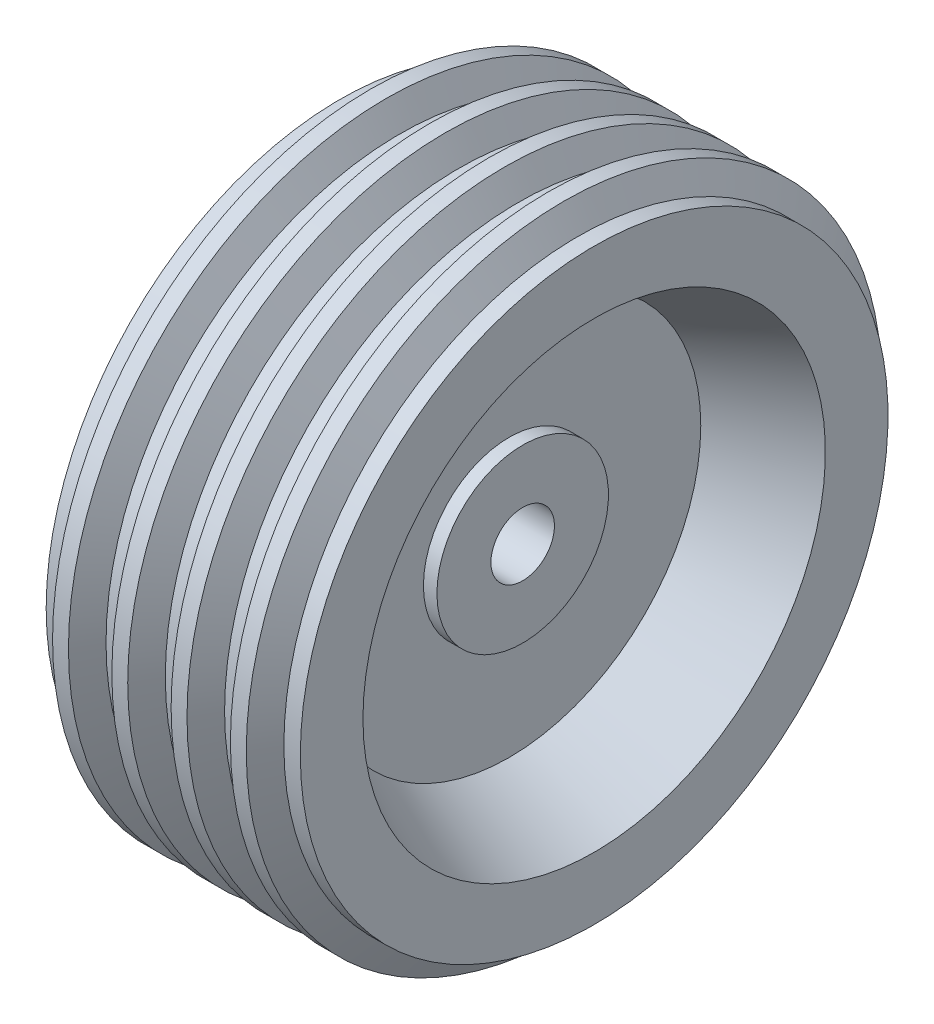
ISO-10303-21;
HEADER;
FILE_DESCRIPTION(('STEP AP214'),'2;1');
FILE_NAME('part.step','',(''),(''),'','','');
FILE_SCHEMA(('AUTOMOTIVE_DESIGN { 1 0 10303 214 1 1 1 1 }'));
ENDSEC;
DATA;
#1=APPLICATION_CONTEXT('core data for automotive mechanical design processes');
#2=APPLICATION_PROTOCOL_DEFINITION('international standard','automotive_design',2000,#1);
#3=PRODUCT_CONTEXT('',#1,'mechanical');
#4=PRODUCT('Part','Part','',(#3));
#5=PRODUCT_RELATED_PRODUCT_CATEGORY('part','',(#4));
#6=PRODUCT_DEFINITION_FORMATION('','',#4);
#7=PRODUCT_DEFINITION_CONTEXT('part definition',#1,'design');
#8=PRODUCT_DEFINITION('design','',#6,#7);
#9=PRODUCT_DEFINITION_SHAPE('','',#8);
#10=(LENGTH_UNIT() NAMED_UNIT(*) SI_UNIT(.MILLI.,.METRE.));
#11=(NAMED_UNIT(*) PLANE_ANGLE_UNIT() SI_UNIT($,.RADIAN.));
#12=(NAMED_UNIT(*) SI_UNIT($,.STERADIAN.) SOLID_ANGLE_UNIT());
#13=UNCERTAINTY_MEASURE_WITH_UNIT(LENGTH_MEASURE(1.E-05),#10,'distance_accuracy_value','');
#14=(GEOMETRIC_REPRESENTATION_CONTEXT(3) GLOBAL_UNCERTAINTY_ASSIGNED_CONTEXT((#13)) GLOBAL_UNIT_ASSIGNED_CONTEXT((#10,
#11,#12)) REPRESENTATION_CONTEXT('',''));
#15=CARTESIAN_POINT('',(0.,0.,0.));
#16=DIRECTION('',(0.,0.,1.));
#17=DIRECTION('',(1.,0.,0.));
#18=AXIS2_PLACEMENT_3D('',#15,#16,#17);
#19=CARTESIAN_POINT('',(-192.570696620357,0.,0.));
#20=DIRECTION('',(-1.,0.,0.));
#21=DIRECTION('',(0.,0.,1.));
#22=AXIS2_PLACEMENT_3D('',#19,#20,#21);
#23=CYLINDRICAL_SURFACE('',#22,20.);
#24=CARTESIAN_POINT('',(35.,0.,0.));
#25=DIRECTION('',(-1.,0.,0.));
#26=DIRECTION('',(0.,0.,1.));
#27=AXIS2_PLACEMENT_3D('',#24,#25,#26);
#28=CIRCLE('',#27,20.);
#29=CARTESIAN_POINT('',(35.,0.,20.));
#30=VERTEX_POINT('',#29);
#31=EDGE_CURVE('E10',#30,#30,#28,.T.);
#32=ORIENTED_EDGE('',*,*,#31,.F.);
#33=EDGE_LOOP('',(#32));
#34=FACE_BOUND('',#33,.T.);
#35=CARTESIAN_POINT('',(-35.,0.,0.));
#36=DIRECTION('',(-1.,0.,0.));
#37=DIRECTION('',(0.,0.,1.));
#38=AXIS2_PLACEMENT_3D('',#35,#36,#37);
#39=CIRCLE('',#38,20.);
#40=CARTESIAN_POINT('',(-35.,0.,20.));
#41=VERTEX_POINT('',#40);
#42=EDGE_CURVE('E152',#41,#41,#39,.T.);
#43=ORIENTED_EDGE('',*,*,#42,.T.);
#44=EDGE_LOOP('',(#43));
#45=FACE_BOUND('',#44,.T.);
#46=ADVANCED_FACE('F37',(#34,#45),#23,.F.);
#47=CARTESIAN_POINT('',(35.,0.,0.));
#48=DIRECTION('',(-1.,0.,0.));
#49=DIRECTION('',(0.,0.,1.));
#50=AXIS2_PLACEMENT_3D('',#47,#48,#49);
#51=PLANE('',#50);
#52=CARTESIAN_POINT('',(35.,0.,0.));
#53=DIRECTION('',(-1.,0.,0.));
#54=DIRECTION('',(0.,0.,1.));
#55=AXIS2_PLACEMENT_3D('',#52,#53,#54);
#56=CIRCLE('',#55,54.);
#57=CARTESIAN_POINT('',(35.,0.,54.));
#58=VERTEX_POINT('',#57);
#59=EDGE_CURVE('E44',#58,#58,#56,.T.);
#60=ORIENTED_EDGE('',*,*,#59,.F.);
#61=EDGE_LOOP('',(#60));
#62=FACE_BOUND('',#61,.T.);
#63=ORIENTED_EDGE('',*,*,#31,.T.);
#64=EDGE_LOOP('',(#63));
#65=FACE_BOUND('',#64,.T.);
#66=ADVANCED_FACE('F170',(#62,#65),#51,.F.);
#67=CARTESIAN_POINT('',(-192.570696620357,0.,0.));
#68=DIRECTION('',(-1.,0.,0.));
#69=DIRECTION('',(0.,0.,1.));
#70=AXIS2_PLACEMENT_3D('',#67,#68,#69);
#71=CYLINDRICAL_SURFACE('',#70,54.);
#72=CARTESIAN_POINT('',(26.5,0.,0.));
#73=DIRECTION('',(-1.,0.,0.));
#74=DIRECTION('',(0.,0.,1.));
#75=AXIS2_PLACEMENT_3D('',#72,#73,#74);
#76=CIRCLE('',#75,54.);
#77=CARTESIAN_POINT('',(26.5,0.,54.));
#78=VERTEX_POINT('',#77);
#79=EDGE_CURVE('E49',#78,#78,#76,.T.);
#80=ORIENTED_EDGE('',*,*,#79,.F.);
#81=EDGE_LOOP('',(#80));
#82=FACE_BOUND('',#81,.T.);
#83=ORIENTED_EDGE('',*,*,#59,.T.);
#84=EDGE_LOOP('',(#83));
#85=FACE_BOUND('',#84,.T.);
#86=ADVANCED_FACE('F175',(#82,#85),#71,.T.);
#87=CARTESIAN_POINT('',(26.5,0.,0.));
#88=DIRECTION('',(1.,0.,0.));
#89=DIRECTION('',(0.,0.,-1.));
#90=AXIS2_PLACEMENT_3D('',#87,#88,#89);
#91=PLANE('',#90);
#92=ORIENTED_EDGE('',*,*,#79,.T.);
#93=EDGE_LOOP('',(#92));
#94=FACE_BOUND('',#93,.T.);
#95=CARTESIAN_POINT('',(26.5,0.,0.));
#96=DIRECTION('',(-1.,0.,0.));
#97=DIRECTION('',(0.,0.,1.));
#98=AXIS2_PLACEMENT_3D('',#95,#96,#97);
#99=CIRCLE('',#98,120.622540288708);
#100=CARTESIAN_POINT('',(26.5,0.,120.622540288708));
#101=VERTEX_POINT('',#100);
#102=EDGE_CURVE('E54',#101,#101,#99,.T.);
#103=ORIENTED_EDGE('',*,*,#102,.F.);
#104=EDGE_LOOP('',(#103));
#105=FACE_BOUND('',#104,.T.);
#106=ADVANCED_FACE('F180',(#94,#105),#91,.T.);
#107=CARTESIAN_POINT('',(80.,0.,0.));
#108=DIRECTION('',(1.,0.,0.));
#109=DIRECTION('',(0.,0.,-1.));
#110=AXIS2_PLACEMENT_3D('',#107,#108,#109);
#111=CONICAL_SURFACE('',#110,145.57,0.436332312998579);
#112=ORIENTED_EDGE('',*,*,#102,.T.);
#113=EDGE_LOOP('',(#112));
#114=FACE_BOUND('',#113,.T.);
#115=CARTESIAN_POINT('',(80.,0.,0.));
#116=DIRECTION('',(-1.,0.,0.));
#117=DIRECTION('',(0.,0.,1.));
#118=AXIS2_PLACEMENT_3D('',#115,#116,#117);
#119=CIRCLE('',#118,145.57);
#120=CARTESIAN_POINT('',(80.,0.,145.57));
#121=VERTEX_POINT('',#120);
#122=EDGE_CURVE('E60',#121,#121,#119,.T.);
#123=ORIENTED_EDGE('',*,*,#122,.F.);
#124=EDGE_LOOP('',(#123));
#125=FACE_BOUND('',#124,.T.);
#126=ADVANCED_FACE('F186',(#114,#125),#111,.F.);
#127=CARTESIAN_POINT('',(80.,0.,0.));
#128=DIRECTION('',(1.,0.,0.));
#129=DIRECTION('',(0.,0.,-1.));
#130=AXIS2_PLACEMENT_3D('',#127,#128,#129);
#131=PLANE('',#130);
#132=ORIENTED_EDGE('',*,*,#122,.T.);
#133=EDGE_LOOP('',(#132));
#134=FACE_BOUND('',#133,.T.);
#135=CARTESIAN_POINT('',(80.,0.,0.));
#136=DIRECTION('',(-1.,0.,0.));
#137=DIRECTION('',(0.,0.,1.));
#138=AXIS2_PLACEMENT_3D('',#135,#136,#137);
#139=CIRCLE('',#138,185.);
#140=CARTESIAN_POINT('',(80.,0.,185.));
#141=VERTEX_POINT('',#140);
#142=EDGE_CURVE('E64',#141,#141,#139,.T.);
#143=ORIENTED_EDGE('',*,*,#142,.F.);
#144=EDGE_LOOP('',(#143));
#145=FACE_BOUND('',#144,.T.);
#146=ADVANCED_FACE('F190',(#134,#145),#131,.T.);
#147=CARTESIAN_POINT('',(-192.570696620357,0.,0.));
#148=DIRECTION('',(-1.,0.,0.));
#149=DIRECTION('',(0.,0.,1.));
#150=AXIS2_PLACEMENT_3D('',#147,#148,#149);
#151=CYLINDRICAL_SURFACE('',#150,185.);
#152=CARTESIAN_POINT('',(69.6410161513781,0.,0.));
#153=DIRECTION('',(-1.,0.,0.));
#154=DIRECTION('',(0.,0.,1.));
#155=AXIS2_PLACEMENT_3D('',#152,#153,#154);
#156=CIRCLE('',#155,185.);
#157=CARTESIAN_POINT('',(69.6410161513781,0.,185.));
#158=VERTEX_POINT('',#157);
#159=EDGE_CURVE('E68',#158,#158,#156,.T.);
#160=ORIENTED_EDGE('',*,*,#159,.F.);
#161=EDGE_LOOP('',(#160));
#162=FACE_BOUND('',#161,.T.);
#163=ORIENTED_EDGE('',*,*,#142,.T.);
#164=EDGE_LOOP('',(#163));
#165=FACE_BOUND('',#164,.T.);
#166=ADVANCED_FACE('F194',(#162,#165),#151,.T.);
#167=CARTESIAN_POINT('',(69.6410161513781,0.,0.));
#168=DIRECTION('',(-1.,0.,0.));
#169=DIRECTION('',(0.,0.,1.));
#170=AXIS2_PLACEMENT_3D('',#167,#168,#169);
#171=CONICAL_SURFACE('',#170,185.,1.04719755119659);
#172=CARTESIAN_POINT('',(60.9807621135336,0.,0.));
#173=DIRECTION('',(-1.,0.,0.));
#174=DIRECTION('',(0.,0.,1.));
#175=AXIS2_PLACEMENT_3D('',#172,#173,#174);
#176=CIRCLE('',#175,200.);
#177=CARTESIAN_POINT('',(60.9807621135336,0.,200.));
#178=VERTEX_POINT('',#177);
#179=EDGE_CURVE('E72',#178,#178,#176,.T.);
#180=ORIENTED_EDGE('',*,*,#179,.F.);
#181=EDGE_LOOP('',(#180));
#182=FACE_BOUND('',#181,.T.);
#183=ORIENTED_EDGE('',*,*,#159,.T.);
#184=EDGE_LOOP('',(#183));
#185=FACE_BOUND('',#184,.T.);
#186=ADVANCED_FACE('F198',(#182,#185),#171,.T.);
#187=CARTESIAN_POINT('',(-192.570696620357,0.,0.));
#188=DIRECTION('',(-1.,0.,0.));
#189=DIRECTION('',(0.,0.,1.));
#190=AXIS2_PLACEMENT_3D('',#187,#188,#189);
#191=CYLINDRICAL_SURFACE('',#190,199.999999999999);
#192=CARTESIAN_POINT('',(50.9807621135336,0.,0.));
#193=DIRECTION('',(-1.,0.,0.));
#194=DIRECTION('',(0.,0.,1.));
#195=AXIS2_PLACEMENT_3D('',#192,#193,#194);
#196=CIRCLE('',#195,199.999999999998);
#197=CARTESIAN_POINT('',(50.9807621135336,0.,199.999999999998));
#198=VERTEX_POINT('',#197);
#199=EDGE_CURVE('E76',#198,#198,#196,.T.);
#200=ORIENTED_EDGE('',*,*,#199,.F.);
#201=EDGE_LOOP('',(#200));
#202=FACE_BOUND('',#201,.T.);
#203=ORIENTED_EDGE('',*,*,#179,.T.);
#204=EDGE_LOOP('',(#203));
#205=FACE_BOUND('',#204,.T.);
#206=ADVANCED_FACE('F202',(#202,#205),#191,.T.);
#207=CARTESIAN_POINT('',(50.9807621135336,0.,0.));
#208=DIRECTION('',(1.,0.,0.));
#209=DIRECTION('',(0.,0.,-1.));
#210=AXIS2_PLACEMENT_3D('',#207,#208,#209);
#211=CONICAL_SURFACE('',#210,199.999999999998,1.04719755119659);
#212=CARTESIAN_POINT('',(42.3205080756901,0.,0.));
#213=DIRECTION('',(-1.,0.,0.));
#214=DIRECTION('',(0.,0.,1.));
#215=AXIS2_PLACEMENT_3D('',#212,#213,#214);
#216=CIRCLE('',#215,185.);
#217=CARTESIAN_POINT('',(42.3205080756901,0.,185.));
#218=VERTEX_POINT('',#217);
#219=EDGE_CURVE('E80',#218,#218,#216,.T.);
#220=ORIENTED_EDGE('',*,*,#219,.F.);
#221=EDGE_LOOP('',(#220));
#222=FACE_BOUND('',#221,.T.);
#223=ORIENTED_EDGE('',*,*,#199,.T.);
#224=EDGE_LOOP('',(#223));
#225=FACE_BOUND('',#224,.T.);
#226=ADVANCED_FACE('F206',(#222,#225),#211,.T.);
#227=CARTESIAN_POINT('',(-192.570696620357,0.,0.));
#228=DIRECTION('',(-1.,0.,0.));
#229=DIRECTION('',(0.,0.,1.));
#230=AXIS2_PLACEMENT_3D('',#227,#228,#229);
#231=CYLINDRICAL_SURFACE('',#230,185.);
#232=CARTESIAN_POINT('',(32.3205080756901,0.,0.));
#233=DIRECTION('',(-1.,0.,0.));
#234=DIRECTION('',(0.,0.,1.));
#235=AXIS2_PLACEMENT_3D('',#232,#233,#234);
#236=CIRCLE('',#235,185.);
#237=CARTESIAN_POINT('',(32.3205080756901,0.,185.));
#238=VERTEX_POINT('',#237);
#239=EDGE_CURVE('E84',#238,#238,#236,.T.);
#240=ORIENTED_EDGE('',*,*,#239,.F.);
#241=EDGE_LOOP('',(#240));
#242=FACE_BOUND('',#241,.T.);
#243=ORIENTED_EDGE('',*,*,#219,.T.);
#244=EDGE_LOOP('',(#243));
#245=FACE_BOUND('',#244,.T.);
#246=ADVANCED_FACE('F210',(#242,#245),#231,.T.);
#247=CARTESIAN_POINT('',(23.6602540378456,0.,0.));
#248=DIRECTION('',(-1.,0.,0.));
#249=DIRECTION('',(0.,0.,1.));
#250=AXIS2_PLACEMENT_3D('',#247,#248,#249);
#251=CONICAL_SURFACE('',#250,200.,1.04719755119659);
#252=ORIENTED_EDGE('',*,*,#239,.T.);
#253=EDGE_LOOP('',(#252));
#254=FACE_BOUND('',#253,.T.);
#255=CARTESIAN_POINT('',(23.6602540378456,0.,0.));
#256=DIRECTION('',(-1.,0.,0.));
#257=DIRECTION('',(0.,0.,1.));
#258=AXIS2_PLACEMENT_3D('',#255,#256,#257);
#259=CIRCLE('',#258,200.);
#260=CARTESIAN_POINT('',(23.6602540378456,0.,200.));
#261=VERTEX_POINT('',#260);
#262=EDGE_CURVE('E88',#261,#261,#259,.T.);
#263=ORIENTED_EDGE('',*,*,#262,.F.);
#264=EDGE_LOOP('',(#263));
#265=FACE_BOUND('',#264,.T.);
#266=ADVANCED_FACE('F214',(#254,#265),#251,.T.);
#267=CARTESIAN_POINT('',(-192.570696620357,0.,0.));
#268=DIRECTION('',(-1.,0.,0.));
#269=DIRECTION('',(0.,0.,1.));
#270=AXIS2_PLACEMENT_3D('',#267,#268,#269);
#271=CYLINDRICAL_SURFACE('',#270,200.);
#272=ORIENTED_EDGE('',*,*,#262,.T.);
#273=EDGE_LOOP('',(#272));
#274=FACE_BOUND('',#273,.T.);
#275=CARTESIAN_POINT('',(13.6602540378456,0.,0.));
#276=DIRECTION('',(-1.,0.,0.));
#277=DIRECTION('',(0.,0.,1.));
#278=AXIS2_PLACEMENT_3D('',#275,#276,#277);
#279=CIRCLE('',#278,200.);
#280=CARTESIAN_POINT('',(13.6602540378456,0.,200.));
#281=VERTEX_POINT('',#280);
#282=EDGE_CURVE('E92',#281,#281,#279,.T.);
#283=ORIENTED_EDGE('',*,*,#282,.F.);
#284=EDGE_LOOP('',(#283));
#285=FACE_BOUND('',#284,.T.);
#286=ADVANCED_FACE('F218',(#274,#285),#271,.T.);
#287=CARTESIAN_POINT('',(5.0000000000005,0.,0.));
#288=DIRECTION('',(1.,0.,0.));
#289=DIRECTION('',(0.,0.,-1.));
#290=AXIS2_PLACEMENT_3D('',#287,#288,#289);
#291=CONICAL_SURFACE('',#290,185.,1.04719755119657);
#292=ORIENTED_EDGE('',*,*,#282,.T.);
#293=EDGE_LOOP('',(#292));
#294=FACE_BOUND('',#293,.T.);
#295=CARTESIAN_POINT('',(5.0000000000005,0.,0.));
#296=DIRECTION('',(-1.,0.,0.));
#297=DIRECTION('',(0.,0.,1.));
#298=AXIS2_PLACEMENT_3D('',#295,#296,#297);
#299=CIRCLE('',#298,185.);
#300=CARTESIAN_POINT('',(5.0000000000005,0.,185.));
#301=VERTEX_POINT('',#300);
#302=EDGE_CURVE('E96',#301,#301,#299,.T.);
#303=ORIENTED_EDGE('',*,*,#302,.F.);
#304=EDGE_LOOP('',(#303));
#305=FACE_BOUND('',#304,.T.);
#306=ADVANCED_FACE('F222',(#294,#305),#291,.T.);
#307=CARTESIAN_POINT('',(-192.570696620357,0.,0.));
#308=DIRECTION('',(-1.,0.,0.));
#309=DIRECTION('',(0.,0.,1.));
#310=AXIS2_PLACEMENT_3D('',#307,#308,#309);
#311=CYLINDRICAL_SURFACE('',#310,185.);
#312=ORIENTED_EDGE('',*,*,#302,.T.);
#313=EDGE_LOOP('',(#312));
#314=FACE_BOUND('',#313,.T.);
#315=CARTESIAN_POINT('',(-5.0000000000005,0.,0.));
#316=DIRECTION('',(-1.,0.,0.));
#317=DIRECTION('',(0.,0.,1.));
#318=AXIS2_PLACEMENT_3D('',#315,#316,#317);
#319=CIRCLE('',#318,185.);
#320=CARTESIAN_POINT('',(-5.0000000000005,0.,185.));
#321=VERTEX_POINT('',#320);
#322=EDGE_CURVE('E100',#321,#321,#319,.T.);
#323=ORIENTED_EDGE('',*,*,#322,.F.);
#324=EDGE_LOOP('',(#323));
#325=FACE_BOUND('',#324,.T.);
#326=ADVANCED_FACE('F226',(#314,#325),#311,.T.);
#327=CARTESIAN_POINT('',(-5.0000000000005,0.,0.));
#328=DIRECTION('',(-1.,0.,0.));
#329=DIRECTION('',(0.,0.,1.));
#330=AXIS2_PLACEMENT_3D('',#327,#328,#329);
#331=CONICAL_SURFACE('',#330,185.,1.04719755119656);
#332=CARTESIAN_POINT('',(-13.6602540378456,0.,0.));
#333=DIRECTION('',(-1.,0.,0.));
#334=DIRECTION('',(0.,0.,1.));
#335=AXIS2_PLACEMENT_3D('',#332,#333,#334);
#336=CIRCLE('',#335,200.);
#337=CARTESIAN_POINT('',(-13.6602540378456,0.,200.));
#338=VERTEX_POINT('',#337);
#339=EDGE_CURVE('E104',#338,#338,#336,.T.);
#340=ORIENTED_EDGE('',*,*,#339,.F.);
#341=EDGE_LOOP('',(#340));
#342=FACE_BOUND('',#341,.T.);
#343=ORIENTED_EDGE('',*,*,#322,.T.);
#344=EDGE_LOOP('',(#343));
#345=FACE_BOUND('',#344,.T.);
#346=ADVANCED_FACE('F230',(#342,#345),#331,.T.);
#347=CARTESIAN_POINT('',(-192.570696620357,0.,0.));
#348=DIRECTION('',(-1.,0.,0.));
#349=DIRECTION('',(0.,0.,1.));
#350=AXIS2_PLACEMENT_3D('',#347,#348,#349);
#351=CYLINDRICAL_SURFACE('',#350,200.);
#352=CARTESIAN_POINT('',(-23.6602540378456,0.,0.));
#353=DIRECTION('',(-1.,0.,0.));
#354=DIRECTION('',(0.,0.,1.));
#355=AXIS2_PLACEMENT_3D('',#352,#353,#354);
#356=CIRCLE('',#355,200.);
#357=CARTESIAN_POINT('',(-23.6602540378456,0.,200.));
#358=VERTEX_POINT('',#357);
#359=EDGE_CURVE('E108',#358,#358,#356,.T.);
#360=ORIENTED_EDGE('',*,*,#359,.F.);
#361=EDGE_LOOP('',(#360));
#362=FACE_BOUND('',#361,.T.);
#363=ORIENTED_EDGE('',*,*,#339,.T.);
#364=EDGE_LOOP('',(#363));
#365=FACE_BOUND('',#364,.T.);
#366=ADVANCED_FACE('F234',(#362,#365),#351,.T.);
#367=CARTESIAN_POINT('',(-23.6602540378456,0.,0.));
#368=DIRECTION('',(1.,0.,0.));
#369=DIRECTION('',(0.,0.,-1.));
#370=AXIS2_PLACEMENT_3D('',#367,#368,#369);
#371=CONICAL_SURFACE('',#370,200.,1.04719755119659);
#372=CARTESIAN_POINT('',(-32.3205080756901,0.,0.));
#373=DIRECTION('',(-1.,0.,0.));
#374=DIRECTION('',(0.,0.,1.));
#375=AXIS2_PLACEMENT_3D('',#372,#373,#374);
#376=CIRCLE('',#375,185.);
#377=CARTESIAN_POINT('',(-32.3205080756901,0.,185.));
#378=VERTEX_POINT('',#377);
#379=EDGE_CURVE('E112',#378,#378,#376,.T.);
#380=ORIENTED_EDGE('',*,*,#379,.F.);
#381=EDGE_LOOP('',(#380));
#382=FACE_BOUND('',#381,.T.);
#383=ORIENTED_EDGE('',*,*,#359,.T.);
#384=EDGE_LOOP('',(#383));
#385=FACE_BOUND('',#384,.T.);
#386=ADVANCED_FACE('F238',(#382,#385),#371,.T.);
#387=CARTESIAN_POINT('',(-192.570696620357,0.,0.));
#388=DIRECTION('',(-1.,0.,0.));
#389=DIRECTION('',(0.,0.,1.));
#390=AXIS2_PLACEMENT_3D('',#387,#388,#389);
#391=CYLINDRICAL_SURFACE('',#390,185.);
#392=CARTESIAN_POINT('',(-42.3205080756901,0.,0.));
#393=DIRECTION('',(-1.,0.,0.));
#394=DIRECTION('',(0.,0.,1.));
#395=AXIS2_PLACEMENT_3D('',#392,#393,#394);
#396=CIRCLE('',#395,185.);
#397=CARTESIAN_POINT('',(-42.3205080756901,0.,185.));
#398=VERTEX_POINT('',#397);
#399=EDGE_CURVE('E116',#398,#398,#396,.T.);
#400=ORIENTED_EDGE('',*,*,#399,.F.);
#401=EDGE_LOOP('',(#400));
#402=FACE_BOUND('',#401,.T.);
#403=ORIENTED_EDGE('',*,*,#379,.T.);
#404=EDGE_LOOP('',(#403));
#405=FACE_BOUND('',#404,.T.);
#406=ADVANCED_FACE('F242',(#402,#405),#391,.T.);
#407=CARTESIAN_POINT('',(-50.9807621135335,0.,0.));
#408=DIRECTION('',(-1.,0.,0.));
#409=DIRECTION('',(0.,0.,1.));
#410=AXIS2_PLACEMENT_3D('',#407,#408,#409);
#411=CONICAL_SURFACE('',#410,199.999999999998,1.04719755119659);
#412=ORIENTED_EDGE('',*,*,#399,.T.);
#413=EDGE_LOOP('',(#412));
#414=FACE_BOUND('',#413,.T.);
#415=CARTESIAN_POINT('',(-50.9807621135335,0.,0.));
#416=DIRECTION('',(-1.,0.,0.));
#417=DIRECTION('',(0.,0.,1.));
#418=AXIS2_PLACEMENT_3D('',#415,#416,#417);
#419=CIRCLE('',#418,199.999999999998);
#420=CARTESIAN_POINT('',(-50.9807621135335,0.,199.999999999998));
#421=VERTEX_POINT('',#420);
#422=EDGE_CURVE('E120',#421,#421,#419,.T.);
#423=ORIENTED_EDGE('',*,*,#422,.F.);
#424=EDGE_LOOP('',(#423));
#425=FACE_BOUND('',#424,.T.);
#426=ADVANCED_FACE('F246',(#414,#425),#411,.T.);
#427=CARTESIAN_POINT('',(-192.570696620357,0.,0.));
#428=DIRECTION('',(-1.,0.,0.));
#429=DIRECTION('',(0.,0.,1.));
#430=AXIS2_PLACEMENT_3D('',#427,#428,#429);
#431=CYLINDRICAL_SURFACE('',#430,199.999999999999);
#432=ORIENTED_EDGE('',*,*,#422,.T.);
#433=EDGE_LOOP('',(#432));
#434=FACE_BOUND('',#433,.T.);
#435=CARTESIAN_POINT('',(-60.9807621135336,0.,0.));
#436=DIRECTION('',(-1.,0.,0.));
#437=DIRECTION('',(0.,0.,1.));
#438=AXIS2_PLACEMENT_3D('',#435,#436,#437);
#439=CIRCLE('',#438,200.);
#440=CARTESIAN_POINT('',(-60.9807621135336,0.,200.));
#441=VERTEX_POINT('',#440);
#442=EDGE_CURVE('E124',#441,#441,#439,.T.);
#443=ORIENTED_EDGE('',*,*,#442,.F.);
#444=EDGE_LOOP('',(#443));
#445=FACE_BOUND('',#444,.T.);
#446=ADVANCED_FACE('F250',(#434,#445),#431,.T.);
#447=CARTESIAN_POINT('',(-69.6410161513781,0.,0.));
#448=DIRECTION('',(1.,0.,0.));
#449=DIRECTION('',(0.,0.,-1.));
#450=AXIS2_PLACEMENT_3D('',#447,#448,#449);
#451=CONICAL_SURFACE('',#450,185.,1.04719755119659);
#452=ORIENTED_EDGE('',*,*,#442,.T.);
#453=EDGE_LOOP('',(#452));
#454=FACE_BOUND('',#453,.T.);
#455=CARTESIAN_POINT('',(-69.6410161513781,0.,0.));
#456=DIRECTION('',(-1.,0.,0.));
#457=DIRECTION('',(0.,0.,1.));
#458=AXIS2_PLACEMENT_3D('',#455,#456,#457);
#459=CIRCLE('',#458,185.);
#460=CARTESIAN_POINT('',(-69.6410161513781,0.,185.));
#461=VERTEX_POINT('',#460);
#462=EDGE_CURVE('E128',#461,#461,#459,.T.);
#463=ORIENTED_EDGE('',*,*,#462,.F.);
#464=EDGE_LOOP('',(#463));
#465=FACE_BOUND('',#464,.T.);
#466=ADVANCED_FACE('F254',(#454,#465),#451,.T.);
#467=CARTESIAN_POINT('',(-192.570696620357,0.,0.));
#468=DIRECTION('',(-1.,0.,0.));
#469=DIRECTION('',(0.,0.,1.));
#470=AXIS2_PLACEMENT_3D('',#467,#468,#469);
#471=CYLINDRICAL_SURFACE('',#470,185.);
#472=ORIENTED_EDGE('',*,*,#462,.T.);
#473=EDGE_LOOP('',(#472));
#474=FACE_BOUND('',#473,.T.);
#475=CARTESIAN_POINT('',(-80.,0.,0.));
#476=DIRECTION('',(-1.,0.,0.));
#477=DIRECTION('',(0.,0.,1.));
#478=AXIS2_PLACEMENT_3D('',#475,#476,#477);
#479=CIRCLE('',#478,185.);
#480=CARTESIAN_POINT('',(-80.,0.,185.));
#481=VERTEX_POINT('',#480);
#482=EDGE_CURVE('E132',#481,#481,#479,.T.);
#483=ORIENTED_EDGE('',*,*,#482,.F.);
#484=EDGE_LOOP('',(#483));
#485=FACE_BOUND('',#484,.T.);
#486=ADVANCED_FACE('F258',(#474,#485),#471,.T.);
#487=CARTESIAN_POINT('',(-80.,0.,0.));
#488=DIRECTION('',(1.,0.,0.));
#489=DIRECTION('',(0.,0.,-1.));
#490=AXIS2_PLACEMENT_3D('',#487,#488,#489);
#491=PLANE('',#490);
#492=CARTESIAN_POINT('',(-80.,0.,0.));
#493=DIRECTION('',(-1.,0.,0.));
#494=DIRECTION('',(0.,0.,1.));
#495=AXIS2_PLACEMENT_3D('',#492,#493,#494);
#496=CIRCLE('',#495,145.57);
#497=CARTESIAN_POINT('',(-80.,0.,145.57));
#498=VERTEX_POINT('',#497);
#499=EDGE_CURVE('E136',#498,#498,#496,.T.);
#500=ORIENTED_EDGE('',*,*,#499,.F.);
#501=EDGE_LOOP('',(#500));
#502=FACE_BOUND('',#501,.T.);
#503=ORIENTED_EDGE('',*,*,#482,.T.);
#504=EDGE_LOOP('',(#503));
#505=FACE_BOUND('',#504,.T.);
#506=ADVANCED_FACE('F262',(#502,#505),#491,.F.);
#507=CARTESIAN_POINT('',(-80.,0.,0.));
#508=DIRECTION('',(-1.,0.,0.));
#509=DIRECTION('',(0.,0.,1.));
#510=AXIS2_PLACEMENT_3D('',#507,#508,#509);
#511=CONICAL_SURFACE('',#510,145.57,0.43633231299858);
#512=CARTESIAN_POINT('',(-26.5,0.,0.));
#513=DIRECTION('',(-1.,0.,0.));
#514=DIRECTION('',(0.,0.,1.));
#515=AXIS2_PLACEMENT_3D('',#512,#513,#514);
#516=CIRCLE('',#515,120.622540288708);
#517=CARTESIAN_POINT('',(-26.5,0.,120.622540288708));
#518=VERTEX_POINT('',#517);
#519=EDGE_CURVE('E140',#518,#518,#516,.T.);
#520=ORIENTED_EDGE('',*,*,#519,.F.);
#521=EDGE_LOOP('',(#520));
#522=FACE_BOUND('',#521,.T.);
#523=ORIENTED_EDGE('',*,*,#499,.T.);
#524=EDGE_LOOP('',(#523));
#525=FACE_BOUND('',#524,.T.);
#526=ADVANCED_FACE('F266',(#522,#525),#511,.F.);
#527=CARTESIAN_POINT('',(-26.5,0.,0.));
#528=DIRECTION('',(1.,0.,0.));
#529=DIRECTION('',(0.,0.,-1.));
#530=AXIS2_PLACEMENT_3D('',#527,#528,#529);
#531=PLANE('',#530);
#532=CARTESIAN_POINT('',(-26.5,0.,0.));
#533=DIRECTION('',(-1.,0.,0.));
#534=DIRECTION('',(0.,0.,1.));
#535=AXIS2_PLACEMENT_3D('',#532,#533,#534);
#536=CIRCLE('',#535,54.);
#537=CARTESIAN_POINT('',(-26.5,0.,54.));
#538=VERTEX_POINT('',#537);
#539=EDGE_CURVE('E144',#538,#538,#536,.T.);
#540=ORIENTED_EDGE('',*,*,#539,.F.);
#541=EDGE_LOOP('',(#540));
#542=FACE_BOUND('',#541,.T.);
#543=ORIENTED_EDGE('',*,*,#519,.T.);
#544=EDGE_LOOP('',(#543));
#545=FACE_BOUND('',#544,.T.);
#546=ADVANCED_FACE('F166',(#542,#545),#531,.F.);
#547=CARTESIAN_POINT('',(-192.570696620357,0.,0.));
#548=DIRECTION('',(-1.,0.,0.));
#549=DIRECTION('',(0.,0.,1.));
#550=AXIS2_PLACEMENT_3D('',#547,#548,#549);
#551=CYLINDRICAL_SURFACE('',#550,54.);
#552=ORIENTED_EDGE('',*,*,#539,.T.);
#553=EDGE_LOOP('',(#552));
#554=FACE_BOUND('',#553,.T.);
#555=CARTESIAN_POINT('',(-35.,0.,0.));
#556=DIRECTION('',(-1.,0.,0.));
#557=DIRECTION('',(0.,0.,1.));
#558=AXIS2_PLACEMENT_3D('',#555,#556,#557);
#559=CIRCLE('',#558,54.);
#560=CARTESIAN_POINT('',(-35.,0.,54.));
#561=VERTEX_POINT('',#560);
#562=EDGE_CURVE('E148',#561,#561,#559,.T.);
#563=ORIENTED_EDGE('',*,*,#562,.F.);
#564=EDGE_LOOP('',(#563));
#565=FACE_BOUND('',#564,.T.);
#566=ADVANCED_FACE('F160',(#554,#565),#551,.T.);
#567=CARTESIAN_POINT('',(-35.,0.,0.));
#568=DIRECTION('',(-1.,0.,0.));
#569=DIRECTION('',(0.,0.,1.));
#570=AXIS2_PLACEMENT_3D('',#567,#568,#569);
#571=PLANE('',#570);
#572=ORIENTED_EDGE('',*,*,#562,.T.);
#573=EDGE_LOOP('',(#572));
#574=FACE_BOUND('',#573,.T.);
#575=ORIENTED_EDGE('',*,*,#42,.F.);
#576=EDGE_LOOP('',(#575));
#577=FACE_BOUND('',#576,.T.);
#578=ADVANCED_FACE('F158',(#574,#577),#571,.T.);
#579=CLOSED_SHELL('',(#46,#66,#86,#106,#126,#146,#166,#186,#206,#226,#246,#266,#286,#306,#326,
#346,#366,#386,#406,#426,#446,#466,#486,#506,#526,#546,#566,#578));
#580=MANIFOLD_SOLID_BREP('B2',#579);
#581=ADVANCED_BREP_SHAPE_REPRESENTATION('',(#18,#580),#14);
#582=SHAPE_DEFINITION_REPRESENTATION(#9,#581);
ENDSEC;
END-ISO-10303-21;
